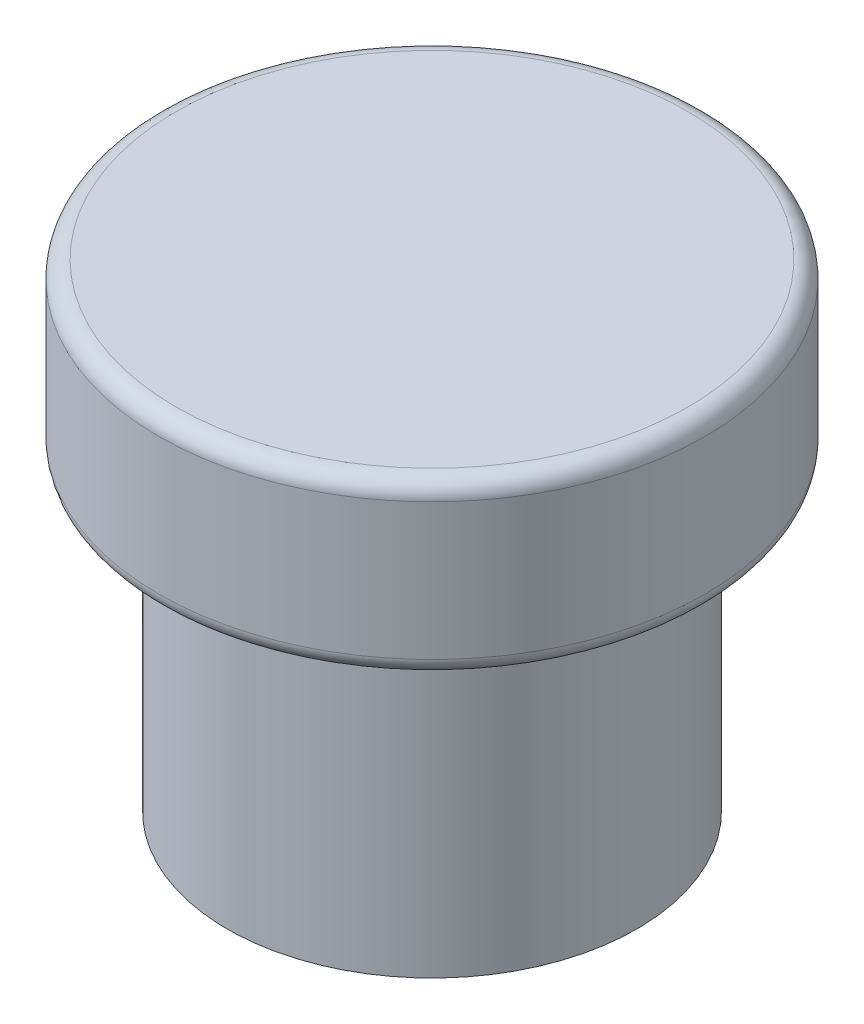
ISO-10303-21;
HEADER;
FILE_DESCRIPTION(('STEP AP214'),'2;1');
FILE_NAME('part.step','',(''),(''),'','','');
FILE_SCHEMA(('AUTOMOTIVE_DESIGN { 1 0 10303 214 1 1 1 1 }'));
ENDSEC;
DATA;
#1=APPLICATION_CONTEXT('core data for automotive mechanical design processes');
#2=APPLICATION_PROTOCOL_DEFINITION('international standard','automotive_design',2000,#1);
#3=PRODUCT_CONTEXT('',#1,'mechanical');
#4=PRODUCT('Part','Part','',(#3));
#5=PRODUCT_RELATED_PRODUCT_CATEGORY('part','',(#4));
#6=PRODUCT_DEFINITION_FORMATION('','',#4);
#7=PRODUCT_DEFINITION_CONTEXT('part definition',#1,'design');
#8=PRODUCT_DEFINITION('design','',#6,#7);
#9=PRODUCT_DEFINITION_SHAPE('','',#8);
#10=(LENGTH_UNIT() NAMED_UNIT(*) SI_UNIT(.MILLI.,.METRE.));
#11=(NAMED_UNIT(*) PLANE_ANGLE_UNIT() SI_UNIT($,.RADIAN.));
#12=(NAMED_UNIT(*) SI_UNIT($,.STERADIAN.) SOLID_ANGLE_UNIT());
#13=UNCERTAINTY_MEASURE_WITH_UNIT(LENGTH_MEASURE(1.E-05),#10,'distance_accuracy_value','');
#14=(GEOMETRIC_REPRESENTATION_CONTEXT(3) GLOBAL_UNCERTAINTY_ASSIGNED_CONTEXT((#13)) GLOBAL_UNIT_ASSIGNED_CONTEXT((#10,
#11,#12)) REPRESENTATION_CONTEXT('',''));
#15=CARTESIAN_POINT('',(0.,0.,0.));
#16=DIRECTION('',(0.,0.,1.));
#17=DIRECTION('',(1.,0.,0.));
#18=AXIS2_PLACEMENT_3D('',#15,#16,#17);
#19=CARTESIAN_POINT('',(0.,0.,0.));
#20=DIRECTION('',(0.,-1.,0.));
#21=DIRECTION('',(0.,0.,-1.));
#22=AXIS2_PLACEMENT_3D('',#19,#20,#21);
#23=PLANE('',#22);
#24=CARTESIAN_POINT('',(0.,0.,0.));
#25=DIRECTION('',(0.,-1.,0.));
#26=DIRECTION('',(0.,0.,-1.));
#27=AXIS2_PLACEMENT_3D('',#24,#25,#26);
#28=CIRCLE('',#27,5.7);
#29=CARTESIAN_POINT('',(0.,0.,-5.7));
#30=VERTEX_POINT('',#29);
#31=EDGE_CURVE('E58',#30,#30,#28,.T.);
#32=ORIENTED_EDGE('',*,*,#31,.F.);
#33=EDGE_LOOP('',(#32));
#34=FACE_BOUND('',#33,.T.);
#35=CARTESIAN_POINT('',(0.,0.,0.));
#36=DIRECTION('',(0.,-1.,0.));
#37=DIRECTION('',(0.,0.,-1.));
#38=AXIS2_PLACEMENT_3D('',#35,#36,#37);
#39=CIRCLE('',#38,6.);
#40=CARTESIAN_POINT('',(0.,0.,-6.));
#41=VERTEX_POINT('',#40);
#42=EDGE_CURVE('E54',#41,#41,#39,.T.);
#43=ORIENTED_EDGE('',*,*,#42,.T.);
#44=EDGE_LOOP('',(#43));
#45=FACE_BOUND('',#44,.T.);
#46=ADVANCED_FACE('F31',(#34,#45),#23,.T.);
#47=CARTESIAN_POINT('',(0.,14.,0.));
#48=DIRECTION('',(0.,1.,0.));
#49=DIRECTION('',(0.,0.,1.));
#50=AXIS2_PLACEMENT_3D('',#47,#48,#49);
#51=PLANE('',#50);
#52=CARTESIAN_POINT('',(0.,14.,0.));
#53=DIRECTION('',(0.,1.,0.));
#54=DIRECTION('',(0.,0.,1.));
#55=AXIS2_PLACEMENT_3D('',#52,#53,#54);
#56=CIRCLE('',#55,7.5);
#57=CARTESIAN_POINT('',(0.,14.,7.5));
#58=VERTEX_POINT('',#57);
#59=EDGE_CURVE('E10',#58,#58,#56,.T.);
#60=ORIENTED_EDGE('',*,*,#59,.T.);
#61=EDGE_LOOP('',(#60));
#62=FACE_BOUND('',#61,.T.);
#63=ADVANCED_FACE('F74',(#62),#51,.T.);
#64=CARTESIAN_POINT('',(0.,0.,0.));
#65=DIRECTION('',(0.,-1.,0.));
#66=DIRECTION('',(0.,0.,-1.));
#67=AXIS2_PLACEMENT_3D('',#64,#65,#66);
#68=CYLINDRICAL_SURFACE('',#67,8.);
#69=CARTESIAN_POINT('',(0.,9.5,0.));
#70=DIRECTION('',(0.,-1.,0.));
#71=DIRECTION('',(0.,0.,-1.));
#72=AXIS2_PLACEMENT_3D('',#69,#70,#71);
#73=CIRCLE('',#72,8.);
#74=CARTESIAN_POINT('',(0.,9.5,-8.));
#75=VERTEX_POINT('',#74);
#76=EDGE_CURVE('E38',#75,#75,#73,.F.);
#77=ORIENTED_EDGE('',*,*,#76,.T.);
#78=EDGE_LOOP('',(#77));
#79=FACE_BOUND('',#78,.T.);
#80=CARTESIAN_POINT('',(0.,13.5,0.));
#81=DIRECTION('',(0.,1.,0.));
#82=DIRECTION('',(0.,0.,1.));
#83=AXIS2_PLACEMENT_3D('',#80,#81,#82);
#84=CIRCLE('',#83,8.);
#85=CARTESIAN_POINT('',(0.,13.5,8.));
#86=VERTEX_POINT('',#85);
#87=EDGE_CURVE('E42',#86,#86,#84,.F.);
#88=ORIENTED_EDGE('',*,*,#87,.T.);
#89=EDGE_LOOP('',(#88));
#90=FACE_BOUND('',#89,.T.);
#91=ADVANCED_FACE('F89',(#79,#90),#68,.T.);
#92=CARTESIAN_POINT('',(0.,9.,-6.));
#93=DIRECTION('',(0.,-1.,0.));
#94=DIRECTION('',(0.,0.,-1.));
#95=AXIS2_PLACEMENT_3D('',#92,#93,#94);
#96=PLANE('',#95);
#97=CARTESIAN_POINT('',(0.,9.,0.));
#98=DIRECTION('',(0.,-1.,0.));
#99=DIRECTION('',(0.,0.,-1.));
#100=AXIS2_PLACEMENT_3D('',#97,#98,#99);
#101=CIRCLE('',#100,7.5);
#102=CARTESIAN_POINT('',(0.,9.,-7.5));
#103=VERTEX_POINT('',#102);
#104=EDGE_CURVE('E46',#103,#103,#101,.T.);
#105=ORIENTED_EDGE('',*,*,#104,.T.);
#106=EDGE_LOOP('',(#105));
#107=FACE_BOUND('',#106,.T.);
#108=CARTESIAN_POINT('',(0.,9.,0.));
#109=DIRECTION('',(0.,-1.,0.));
#110=DIRECTION('',(0.,0.,-1.));
#111=AXIS2_PLACEMENT_3D('',#108,#109,#110);
#112=CIRCLE('',#111,6.);
#113=CARTESIAN_POINT('',(0.,9.,-6.));
#114=VERTEX_POINT('',#113);
#115=EDGE_CURVE('E51',#114,#114,#112,.T.);
#116=ORIENTED_EDGE('',*,*,#115,.F.);
#117=EDGE_LOOP('',(#116));
#118=FACE_BOUND('',#117,.T.);
#119=ADVANCED_FACE('F81',(#107,#118),#96,.T.);
#120=CARTESIAN_POINT('',(0.,0.,0.));
#121=DIRECTION('',(0.,-1.,0.));
#122=DIRECTION('',(0.,0.,-1.));
#123=AXIS2_PLACEMENT_3D('',#120,#121,#122);
#124=CYLINDRICAL_SURFACE('',#123,6.);
#125=ORIENTED_EDGE('',*,*,#115,.T.);
#126=EDGE_LOOP('',(#125));
#127=FACE_BOUND('',#126,.T.);
#128=ORIENTED_EDGE('',*,*,#42,.F.);
#129=EDGE_LOOP('',(#128));
#130=FACE_BOUND('',#129,.T.);
#131=ADVANCED_FACE('F78',(#127,#130),#124,.T.);
#132=CARTESIAN_POINT('',(0.,9.5,0.));
#133=DIRECTION('',(0.,-1.,0.));
#134=DIRECTION('',(0.,0.,-1.));
#135=AXIS2_PLACEMENT_3D('',#132,#133,#134);
#136=TOROIDAL_SURFACE('',#135,7.5,0.5);
#137=ORIENTED_EDGE('',*,*,#76,.F.);
#138=EDGE_LOOP('',(#137));
#139=FACE_BOUND('',#138,.T.);
#140=ORIENTED_EDGE('',*,*,#104,.F.);
#141=EDGE_LOOP('',(#140));
#142=FACE_BOUND('',#141,.T.);
#143=ADVANCED_FACE('F80',(#139,#142),#136,.T.);
#144=CARTESIAN_POINT('',(0.,13.5,0.));
#145=DIRECTION('',(0.,1.,0.));
#146=DIRECTION('',(0.,0.,1.));
#147=AXIS2_PLACEMENT_3D('',#144,#145,#146);
#148=TOROIDAL_SURFACE('',#147,7.5,0.5);
#149=ORIENTED_EDGE('',*,*,#59,.F.);
#150=EDGE_LOOP('',(#149));
#151=FACE_BOUND('',#150,.T.);
#152=ORIENTED_EDGE('',*,*,#87,.F.);
#153=EDGE_LOOP('',(#152));
#154=FACE_BOUND('',#153,.T.);
#155=ADVANCED_FACE('F33',(#151,#154),#148,.T.);
#156=CARTESIAN_POINT('',(0.,10.,0.));
#157=DIRECTION('',(0.,-1.,0.));
#158=DIRECTION('',(0.,0.,-1.));
#159=AXIS2_PLACEMENT_3D('',#156,#157,#158);
#160=CYLINDRICAL_SURFACE('',#159,5.7);
#161=CARTESIAN_POINT('',(0.,10.,0.));
#162=DIRECTION('',(0.,-1.,0.));
#163=DIRECTION('',(0.,0.,-1.));
#164=AXIS2_PLACEMENT_3D('',#161,#162,#163);
#165=CIRCLE('',#164,5.7);
#166=CARTESIAN_POINT('',(0.,10.,-5.7));
#167=VERTEX_POINT('',#166);
#168=EDGE_CURVE('E57',#167,#167,#165,.T.);
#169=ORIENTED_EDGE('',*,*,#168,.F.);
#170=EDGE_LOOP('',(#169));
#171=FACE_BOUND('',#170,.T.);
#172=ORIENTED_EDGE('',*,*,#31,.T.);
#173=EDGE_LOOP('',(#172));
#174=FACE_BOUND('',#173,.T.);
#175=ADVANCED_FACE('F66',(#171,#174),#160,.F.);
#176=CARTESIAN_POINT('',(0.,10.,0.));
#177=DIRECTION('',(0.,-1.,0.));
#178=DIRECTION('',(0.,0.,-1.));
#179=AXIS2_PLACEMENT_3D('',#176,#177,#178);
#180=PLANE('',#179);
#181=ORIENTED_EDGE('',*,*,#168,.T.);
#182=EDGE_LOOP('',(#181));
#183=FACE_BOUND('',#182,.T.);
#184=ADVANCED_FACE('F64',(#183),#180,.T.);
#185=CLOSED_SHELL('',(#46,#63,#91,#119,#131,#143,#155,#175,#184));
#186=MANIFOLD_SOLID_BREP('B2',#185);
#187=ADVANCED_BREP_SHAPE_REPRESENTATION('',(#18,#186),#14);
#188=SHAPE_DEFINITION_REPRESENTATION(#9,#187);
ENDSEC;
END-ISO-10303-21;
